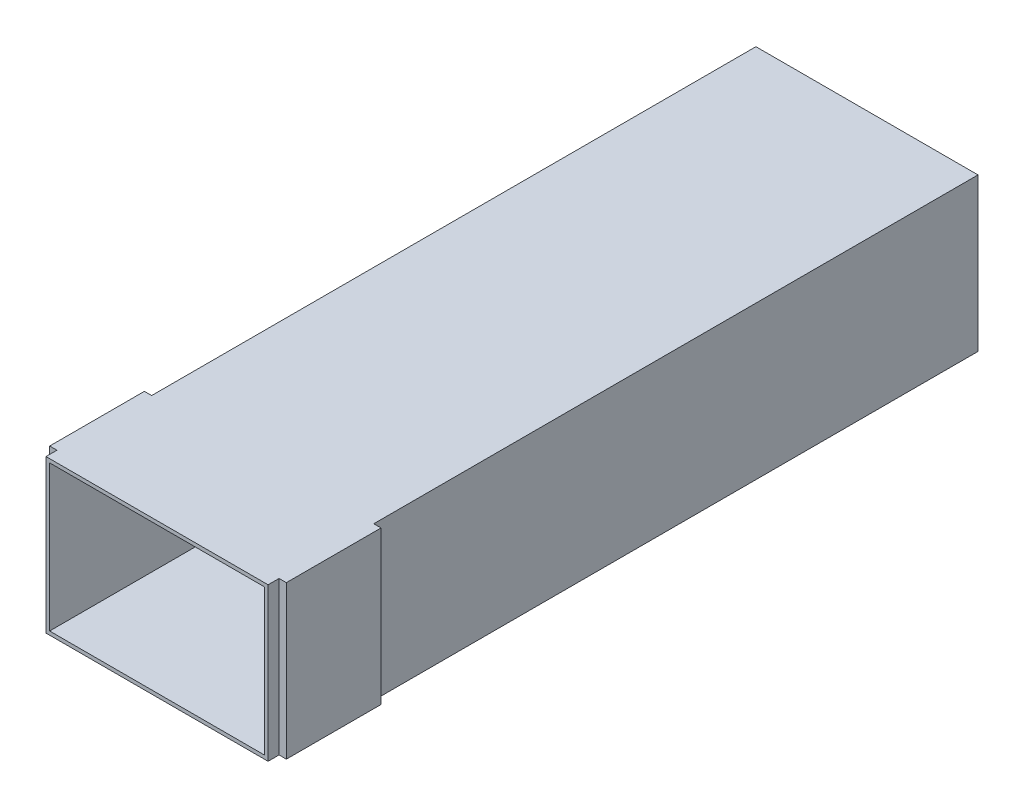
ISO-10303-21;
HEADER;
FILE_DESCRIPTION(('STEP AP214'),'2;1');
FILE_NAME('part.step','',(''),(''),'','','');
FILE_SCHEMA(('AUTOMOTIVE_DESIGN { 1 0 10303 214 1 1 1 1 }'));
ENDSEC;
DATA;
#1=APPLICATION_CONTEXT('core data for automotive mechanical design processes');
#2=APPLICATION_PROTOCOL_DEFINITION('international standard','automotive_design',2000,#1);
#3=PRODUCT_CONTEXT('',#1,'mechanical');
#4=PRODUCT('Part','Part','',(#3));
#5=PRODUCT_RELATED_PRODUCT_CATEGORY('part','',(#4));
#6=PRODUCT_DEFINITION_FORMATION('','',#4);
#7=PRODUCT_DEFINITION_CONTEXT('part definition',#1,'design');
#8=PRODUCT_DEFINITION('design','',#6,#7);
#9=PRODUCT_DEFINITION_SHAPE('','',#8);
#10=(LENGTH_UNIT() NAMED_UNIT(*) SI_UNIT(.MILLI.,.METRE.));
#11=(NAMED_UNIT(*) PLANE_ANGLE_UNIT() SI_UNIT($,.RADIAN.));
#12=(NAMED_UNIT(*) SI_UNIT($,.STERADIAN.) SOLID_ANGLE_UNIT());
#13=UNCERTAINTY_MEASURE_WITH_UNIT(LENGTH_MEASURE(1.E-05),#10,'distance_accuracy_value','');
#14=(GEOMETRIC_REPRESENTATION_CONTEXT(3) GLOBAL_UNCERTAINTY_ASSIGNED_CONTEXT((#13)) GLOBAL_UNIT_ASSIGNED_CONTEXT((#10,
#11,#12)) REPRESENTATION_CONTEXT('',''));
#15=CARTESIAN_POINT('',(0.,0.,0.));
#16=DIRECTION('',(0.,0.,1.));
#17=DIRECTION('',(1.,0.,0.));
#18=AXIS2_PLACEMENT_3D('',#15,#16,#17);
#19=CARTESIAN_POINT('',(-15.25,10.5,-7.99528968755595));
#20=DIRECTION('',(1.,0.,0.));
#21=DIRECTION('',(0.,0.,-1.));
#22=AXIS2_PLACEMENT_3D('',#19,#20,#21);
#23=PLANE('',#22);
#24=DIRECTION('',(0.,0.,1.));
#25=VECTOR('',#24,1.);
#26=CARTESIAN_POINT('',(-15.25,10.5,-7.99528968755595));
#27=LINE('',#26,#25);
#28=CARTESIAN_POINT('',(-15.25,10.5,40.));
#29=VERTEX_POINT('',#28);
#30=CARTESIAN_POINT('',(-15.25,10.5,40.7547103124441));
#31=VERTEX_POINT('',#30);
#32=EDGE_CURVE('E194',#29,#31,#27,.T.);
#33=ORIENTED_EDGE('',*,*,#32,.F.);
#34=DIRECTION('',(0.,-1.,0.));
#35=VECTOR('',#34,1.);
#36=CARTESIAN_POINT('',(-15.25,0.,40.));
#37=LINE('',#36,#35);
#38=CARTESIAN_POINT('',(-15.25,0.,40.));
#39=VERTEX_POINT('',#38);
#40=EDGE_CURVE('E156',#29,#39,#37,.T.);
#41=ORIENTED_EDGE('',*,*,#40,.T.);
#42=DIRECTION('',(0.,0.,1.));
#43=VECTOR('',#42,1.);
#44=CARTESIAN_POINT('',(-15.25,0.,-7.99528968755595));
#45=LINE('',#44,#43);
#46=CARTESIAN_POINT('',(-15.25,0.,40.7547103124441));
#47=VERTEX_POINT('',#46);
#48=EDGE_CURVE('E331',#39,#47,#45,.T.);
#49=ORIENTED_EDGE('',*,*,#48,.T.);
#50=DIRECTION('',(0.,-1.,0.));
#51=VECTOR('',#50,1.);
#52=CARTESIAN_POINT('',(-15.25,10.5,40.7547103124441));
#53=LINE('',#52,#51);
#54=EDGE_CURVE('E11',#31,#47,#53,.T.);
#55=ORIENTED_EDGE('',*,*,#54,.F.);
#56=EDGE_LOOP('',(#33,#41,#49,#55));
#57=FACE_BOUND('',#56,.T.);
#58=ADVANCED_FACE('F33',(#57),#23,.F.);
#59=CARTESIAN_POINT('',(0.,10.5,-7.99528968755595));
#60=DIRECTION('',(-1.,0.,0.));
#61=DIRECTION('',(0.,0.,1.));
#62=AXIS2_PLACEMENT_3D('',#59,#60,#61);
#63=PLANE('',#62);
#64=DIRECTION('',(0.,-1.,0.));
#65=VECTOR('',#64,1.);
#66=CARTESIAN_POINT('',(0.,0.,40.));
#67=LINE('',#66,#65);
#68=CARTESIAN_POINT('',(0.,10.5,40.));
#69=VERTEX_POINT('',#68);
#70=CARTESIAN_POINT('',(0.,0.,40.));
#71=VERTEX_POINT('',#70);
#72=EDGE_CURVE('E58',#69,#71,#67,.T.);
#73=ORIENTED_EDGE('',*,*,#72,.F.);
#74=DIRECTION('',(0.,0.,-1.));
#75=VECTOR('',#74,1.);
#76=CARTESIAN_POINT('',(0.,10.5,-7.99528968755595));
#77=LINE('',#76,#75);
#78=CARTESIAN_POINT('',(0.,10.5,40.7547103124441));
#79=VERTEX_POINT('',#78);
#80=EDGE_CURVE('E217',#79,#69,#77,.T.);
#81=ORIENTED_EDGE('',*,*,#80,.F.);
#82=DIRECTION('',(0.,-1.,0.));
#83=VECTOR('',#82,1.);
#84=CARTESIAN_POINT('',(0.,10.5,40.7547103124441));
#85=LINE('',#84,#83);
#86=CARTESIAN_POINT('',(0.,0.,40.7547103124441));
#87=VERTEX_POINT('',#86);
#88=EDGE_CURVE('E42',#79,#87,#85,.T.);
#89=ORIENTED_EDGE('',*,*,#88,.T.);
#90=DIRECTION('',(0.,0.,-1.));
#91=VECTOR('',#90,1.);
#92=CARTESIAN_POINT('',(0.,0.,-7.99528968755595));
#93=LINE('',#92,#91);
#94=EDGE_CURVE('E222',#87,#71,#93,.T.);
#95=ORIENTED_EDGE('',*,*,#94,.T.);
#96=EDGE_LOOP('',(#73,#81,#89,#95));
#97=FACE_BOUND('',#96,.T.);
#98=ADVANCED_FACE('F238',(#97),#63,.F.);
#99=DIRECTION('',(0.,1.,0.));
#100=VECTOR('',#99,1.);
#101=CARTESIAN_POINT('',(0.,0.,33.5));
#102=LINE('',#101,#100);
#103=CARTESIAN_POINT('',(0.,0.,33.5));
#104=VERTEX_POINT('',#103);
#105=CARTESIAN_POINT('',(0.,10.5,33.5));
#106=VERTEX_POINT('',#105);
#107=EDGE_CURVE('E261',#104,#106,#102,.T.);
#108=ORIENTED_EDGE('',*,*,#107,.F.);
#109=CARTESIAN_POINT('',(0.,0.,-7.99528968755595));
#110=VERTEX_POINT('',#109);
#111=EDGE_CURVE('E219',#104,#110,#93,.T.);
#112=ORIENTED_EDGE('',*,*,#111,.T.);
#113=DIRECTION('',(0.,-1.,0.));
#114=VECTOR('',#113,1.);
#115=CARTESIAN_POINT('',(0.,10.5,-7.99528968755595));
#116=LINE('',#115,#114);
#117=CARTESIAN_POINT('',(0.,10.5,-7.99528968755595));
#118=VERTEX_POINT('',#117);
#119=EDGE_CURVE('E232',#118,#110,#116,.T.);
#120=ORIENTED_EDGE('',*,*,#119,.F.);
#121=EDGE_CURVE('E208',#106,#118,#77,.T.);
#122=ORIENTED_EDGE('',*,*,#121,.F.);
#123=EDGE_LOOP('',(#108,#112,#120,#122));
#124=FACE_BOUND('',#123,.T.);
#125=ADVANCED_FACE('F296',(#124),#63,.F.);
#126=CARTESIAN_POINT('',(-15.25,10.5,40.7547103124441));
#127=DIRECTION('',(0.,0.,-1.));
#128=DIRECTION('',(-1.,0.,0.));
#129=AXIS2_PLACEMENT_3D('',#126,#127,#128);
#130=PLANE('',#129);
#131=DIRECTION('',(1.,0.,0.));
#132=VECTOR('',#131,1.);
#133=CARTESIAN_POINT('',(-15.25,0.,40.7547103124441));
#134=LINE('',#133,#132);
#135=EDGE_CURVE('E223',#47,#87,#134,.T.);
#136=ORIENTED_EDGE('',*,*,#135,.T.);
#137=ORIENTED_EDGE('',*,*,#88,.F.);
#138=DIRECTION('',(1.,0.,0.));
#139=VECTOR('',#138,1.);
#140=CARTESIAN_POINT('',(-15.25,10.5,40.7547103124441));
#141=LINE('',#140,#139);
#142=EDGE_CURVE('E205',#31,#79,#141,.T.);
#143=ORIENTED_EDGE('',*,*,#142,.F.);
#144=ORIENTED_EDGE('',*,*,#54,.T.);
#145=EDGE_LOOP('',(#136,#137,#143,#144));
#146=FACE_BOUND('',#145,.T.);
#147=DIRECTION('',(1.,0.,0.));
#148=VECTOR('',#147,1.);
#149=CARTESIAN_POINT('',(-15.25,0.25,40.7547103124441));
#150=LINE('',#149,#148);
#151=CARTESIAN_POINT('',(-15.,0.25,40.7547103124441));
#152=VERTEX_POINT('',#151);
#153=CARTESIAN_POINT('',(-0.249999999999993,0.25,40.7547103124441));
#154=VERTEX_POINT('',#153);
#155=EDGE_CURVE('E350',#152,#154,#150,.T.);
#156=ORIENTED_EDGE('',*,*,#155,.F.);
#157=DIRECTION('',(0.,-1.,0.));
#158=VECTOR('',#157,1.);
#159=CARTESIAN_POINT('',(-15.,10.5,40.7547103124441));
#160=LINE('',#159,#158);
#161=CARTESIAN_POINT('',(-15.,10.25,40.7547103124441));
#162=VERTEX_POINT('',#161);
#163=EDGE_CURVE('E333',#162,#152,#160,.T.);
#164=ORIENTED_EDGE('',*,*,#163,.F.);
#165=DIRECTION('',(1.,0.,0.));
#166=VECTOR('',#165,1.);
#167=CARTESIAN_POINT('',(-15.25,10.25,40.7547103124441));
#168=LINE('',#167,#166);
#169=CARTESIAN_POINT('',(-0.249999999999993,10.25,40.7547103124441));
#170=VERTEX_POINT('',#169);
#171=EDGE_CURVE('E203',#162,#170,#168,.T.);
#172=ORIENTED_EDGE('',*,*,#171,.T.);
#173=DIRECTION('',(0.,-1.,0.));
#174=VECTOR('',#173,1.);
#175=CARTESIAN_POINT('',(-0.249999999999993,10.5,40.7547103124441));
#176=LINE('',#175,#174);
#177=EDGE_CURVE('E338',#170,#154,#176,.T.);
#178=ORIENTED_EDGE('',*,*,#177,.T.);
#179=EDGE_LOOP('',(#156,#164,#172,#178));
#180=FACE_BOUND('',#179,.T.);
#181=ADVANCED_FACE('F322',(#146,#180),#130,.F.);
#182=CARTESIAN_POINT('',(-15.25,0.,-7.99528968755595));
#183=VERTEX_POINT('',#182);
#184=CARTESIAN_POINT('',(-15.25,0.,33.5));
#185=VERTEX_POINT('',#184);
#186=EDGE_CURVE('E330',#183,#185,#45,.T.);
#187=ORIENTED_EDGE('',*,*,#186,.T.);
#188=DIRECTION('',(0.,1.,0.));
#189=VECTOR('',#188,1.);
#190=CARTESIAN_POINT('',(-15.25,0.,33.5));
#191=LINE('',#190,#189);
#192=CARTESIAN_POINT('',(-15.25,10.5,33.5));
#193=VERTEX_POINT('',#192);
#194=EDGE_CURVE('E167',#185,#193,#191,.T.);
#195=ORIENTED_EDGE('',*,*,#194,.T.);
#196=CARTESIAN_POINT('',(-15.25,10.5,-7.99528968755595));
#197=VERTEX_POINT('',#196);
#198=EDGE_CURVE('E197',#197,#193,#27,.T.);
#199=ORIENTED_EDGE('',*,*,#198,.F.);
#200=DIRECTION('',(0.,-1.,0.));
#201=VECTOR('',#200,1.);
#202=CARTESIAN_POINT('',(-15.25,10.5,-7.99528968755595));
#203=LINE('',#202,#201);
#204=EDGE_CURVE('E229',#197,#183,#203,.T.);
#205=ORIENTED_EDGE('',*,*,#204,.T.);
#206=EDGE_LOOP('',(#187,#195,#199,#205));
#207=FACE_BOUND('',#206,.T.);
#208=ADVANCED_FACE('F35',(#207),#23,.F.);
#209=CARTESIAN_POINT('',(-15.25,10.5,-7.99528968755595));
#210=DIRECTION('',(0.,0.,1.));
#211=DIRECTION('',(1.,0.,0.));
#212=AXIS2_PLACEMENT_3D('',#209,#210,#211);
#213=PLANE('',#212);
#214=DIRECTION('',(-1.,0.,0.));
#215=VECTOR('',#214,1.);
#216=CARTESIAN_POINT('',(-15.25,0.,-7.99528968755595));
#217=LINE('',#216,#215);
#218=EDGE_CURVE('E198',#110,#183,#217,.T.);
#219=ORIENTED_EDGE('',*,*,#218,.T.);
#220=ORIENTED_EDGE('',*,*,#204,.F.);
#221=DIRECTION('',(-1.,0.,0.));
#222=VECTOR('',#221,1.);
#223=CARTESIAN_POINT('',(-15.25,10.5,-7.99528968755595));
#224=LINE('',#223,#222);
#225=EDGE_CURVE('E211',#118,#197,#224,.T.);
#226=ORIENTED_EDGE('',*,*,#225,.F.);
#227=ORIENTED_EDGE('',*,*,#119,.T.);
#228=EDGE_LOOP('',(#219,#220,#226,#227));
#229=FACE_BOUND('',#228,.T.);
#230=ADVANCED_FACE('F299',(#229),#213,.F.);
#231=CARTESIAN_POINT('',(0.,10.5,0.));
#232=DIRECTION('',(0.,1.,0.));
#233=DIRECTION('',(0.,0.,1.));
#234=AXIS2_PLACEMENT_3D('',#231,#232,#233);
#235=PLANE('',#234);
#236=ORIENTED_EDGE('',*,*,#198,.T.);
#237=DIRECTION('',(1.,0.,0.));
#238=VECTOR('',#237,1.);
#239=CARTESIAN_POINT('',(-15.75,10.5,33.5));
#240=LINE('',#239,#238);
#241=CARTESIAN_POINT('',(-15.75,10.5,33.5));
#242=VERTEX_POINT('',#241);
#243=EDGE_CURVE('E50',#242,#193,#240,.T.);
#244=ORIENTED_EDGE('',*,*,#243,.F.);
#245=DIRECTION('',(0.,0.,1.));
#246=VECTOR('',#245,1.);
#247=CARTESIAN_POINT('',(-15.75,10.5,40.));
#248=LINE('',#247,#246);
#249=CARTESIAN_POINT('',(-15.75,10.5,40.));
#250=VERTEX_POINT('',#249);
#251=EDGE_CURVE('E164',#242,#250,#248,.T.);
#252=ORIENTED_EDGE('',*,*,#251,.T.);
#253=DIRECTION('',(1.,0.,0.));
#254=VECTOR('',#253,1.);
#255=CARTESIAN_POINT('',(-15.75,10.5,40.));
#256=LINE('',#255,#254);
#257=EDGE_CURVE('E150',#250,#29,#256,.T.);
#258=ORIENTED_EDGE('',*,*,#257,.T.);
#259=ORIENTED_EDGE('',*,*,#32,.T.);
#260=ORIENTED_EDGE('',*,*,#142,.T.);
#261=ORIENTED_EDGE('',*,*,#80,.T.);
#262=DIRECTION('',(-1.,0.,0.));
#263=VECTOR('',#262,1.);
#264=CARTESIAN_POINT('',(0.500000000000006,10.5,40.));
#265=LINE('',#264,#263);
#266=CARTESIAN_POINT('',(0.500000000000006,10.5,40.));
#267=VERTEX_POINT('',#266);
#268=EDGE_CURVE('E260',#267,#69,#265,.T.);
#269=ORIENTED_EDGE('',*,*,#268,.F.);
#270=DIRECTION('',(0.,0.,1.));
#271=VECTOR('',#270,1.);
#272=CARTESIAN_POINT('',(0.500000000000006,10.5,40.));
#273=LINE('',#272,#271);
#274=CARTESIAN_POINT('',(0.500000000000005,10.5,33.5));
#275=VERTEX_POINT('',#274);
#276=EDGE_CURVE('E273',#275,#267,#273,.T.);
#277=ORIENTED_EDGE('',*,*,#276,.F.);
#278=DIRECTION('',(-1.,0.,0.));
#279=VECTOR('',#278,1.);
#280=CARTESIAN_POINT('',(0.500000000000005,10.5,33.5));
#281=LINE('',#280,#279);
#282=EDGE_CURVE('E279',#275,#106,#281,.T.);
#283=ORIENTED_EDGE('',*,*,#282,.T.);
#284=ORIENTED_EDGE('',*,*,#121,.T.);
#285=ORIENTED_EDGE('',*,*,#225,.T.);
#286=EDGE_LOOP('',(#236,#244,#252,#258,#259,#260,#261,#269,#277,#283,#284,#285));
#287=FACE_BOUND('',#286,.T.);
#288=ADVANCED_FACE('F170',(#287),#235,.T.);
#289=CARTESIAN_POINT('',(0.,0.,0.));
#290=DIRECTION('',(0.,1.,0.));
#291=DIRECTION('',(0.,0.,1.));
#292=AXIS2_PLACEMENT_3D('',#289,#290,#291);
#293=PLANE('',#292);
#294=ORIENTED_EDGE('',*,*,#186,.F.);
#295=ORIENTED_EDGE('',*,*,#218,.F.);
#296=ORIENTED_EDGE('',*,*,#111,.F.);
#297=DIRECTION('',(-1.,0.,0.));
#298=VECTOR('',#297,1.);
#299=CARTESIAN_POINT('',(0.500000000000005,0.,33.5));
#300=LINE('',#299,#298);
#301=CARTESIAN_POINT('',(0.500000000000005,0.,33.5));
#302=VERTEX_POINT('',#301);
#303=EDGE_CURVE('E255',#302,#104,#300,.T.);
#304=ORIENTED_EDGE('',*,*,#303,.F.);
#305=DIRECTION('',(0.,0.,-1.));
#306=VECTOR('',#305,1.);
#307=CARTESIAN_POINT('',(0.500000000000006,0.,40.));
#308=LINE('',#307,#306);
#309=CARTESIAN_POINT('',(0.500000000000006,0.,40.));
#310=VERTEX_POINT('',#309);
#311=EDGE_CURVE('E250',#310,#302,#308,.T.);
#312=ORIENTED_EDGE('',*,*,#311,.F.);
#313=DIRECTION('',(-1.,0.,0.));
#314=VECTOR('',#313,1.);
#315=CARTESIAN_POINT('',(0.500000000000006,0.,40.));
#316=LINE('',#315,#314);
#317=EDGE_CURVE('E248',#310,#71,#316,.T.);
#318=ORIENTED_EDGE('',*,*,#317,.T.);
#319=ORIENTED_EDGE('',*,*,#94,.F.);
#320=ORIENTED_EDGE('',*,*,#135,.F.);
#321=ORIENTED_EDGE('',*,*,#48,.F.);
#322=DIRECTION('',(1.,0.,0.));
#323=VECTOR('',#322,1.);
#324=CARTESIAN_POINT('',(-15.75,0.,40.));
#325=LINE('',#324,#323);
#326=CARTESIAN_POINT('',(-15.75,0.,40.));
#327=VERTEX_POINT('',#326);
#328=EDGE_CURVE('E176',#327,#39,#325,.T.);
#329=ORIENTED_EDGE('',*,*,#328,.F.);
#330=DIRECTION('',(0.,0.,-1.));
#331=VECTOR('',#330,1.);
#332=CARTESIAN_POINT('',(-15.75,0.,40.));
#333=LINE('',#332,#331);
#334=CARTESIAN_POINT('',(-15.75,0.,33.5));
#335=VERTEX_POINT('',#334);
#336=EDGE_CURVE('E166',#327,#335,#333,.T.);
#337=ORIENTED_EDGE('',*,*,#336,.T.);
#338=DIRECTION('',(1.,0.,0.));
#339=VECTOR('',#338,1.);
#340=CARTESIAN_POINT('',(-15.75,0.,33.5));
#341=LINE('',#340,#339);
#342=EDGE_CURVE('E186',#335,#185,#341,.T.);
#343=ORIENTED_EDGE('',*,*,#342,.T.);
#344=EDGE_LOOP('',(#294,#295,#296,#304,#312,#318,#319,#320,#321,#329,#337,#343));
#345=FACE_BOUND('',#344,.T.);
#346=ADVANCED_FACE('F245',(#345),#293,.F.);
#347=CARTESIAN_POINT('',(-15.,10.5,-7.99528968755595));
#348=DIRECTION('',(1.,0.,0.));
#349=DIRECTION('',(0.,0.,-1.));
#350=AXIS2_PLACEMENT_3D('',#347,#348,#349);
#351=PLANE('',#350);
#352=DIRECTION('',(0.,0.,1.));
#353=VECTOR('',#352,1.);
#354=CARTESIAN_POINT('',(-15.,0.25,-7.99528968755595));
#355=LINE('',#354,#353);
#356=CARTESIAN_POINT('',(-15.,0.25,-7.74528968755595));
#357=VERTEX_POINT('',#356);
#358=EDGE_CURVE('E254',#357,#152,#355,.T.);
#359=ORIENTED_EDGE('',*,*,#358,.F.);
#360=DIRECTION('',(0.,-1.,0.));
#361=VECTOR('',#360,1.);
#362=CARTESIAN_POINT('',(-15.,10.5,-7.74528968755595));
#363=LINE('',#362,#361);
#364=CARTESIAN_POINT('',(-15.,10.25,-7.74528968755595));
#365=VERTEX_POINT('',#364);
#366=EDGE_CURVE('E373',#365,#357,#363,.T.);
#367=ORIENTED_EDGE('',*,*,#366,.F.);
#368=DIRECTION('',(0.,0.,1.));
#369=VECTOR('',#368,1.);
#370=CARTESIAN_POINT('',(-15.,10.25,-7.99528968755595));
#371=LINE('',#370,#369);
#372=EDGE_CURVE('E375',#365,#162,#371,.T.);
#373=ORIENTED_EDGE('',*,*,#372,.T.);
#374=ORIENTED_EDGE('',*,*,#163,.T.);
#375=EDGE_LOOP('',(#359,#367,#373,#374));
#376=FACE_BOUND('',#375,.T.);
#377=ADVANCED_FACE('F381',(#376),#351,.T.);
#378=CARTESIAN_POINT('',(-0.25,10.5,-7.99528968755595));
#379=DIRECTION('',(-1.,0.,0.));
#380=DIRECTION('',(0.,0.,1.));
#381=AXIS2_PLACEMENT_3D('',#378,#379,#380);
#382=PLANE('',#381);
#383=DIRECTION('',(0.,0.,-1.));
#384=VECTOR('',#383,1.);
#385=CARTESIAN_POINT('',(-0.25,0.25,-7.99528968755595));
#386=LINE('',#385,#384);
#387=CARTESIAN_POINT('',(-0.25,0.25,-7.74528968755595));
#388=VERTEX_POINT('',#387);
#389=EDGE_CURVE('E351',#154,#388,#386,.T.);
#390=ORIENTED_EDGE('',*,*,#389,.F.);
#391=ORIENTED_EDGE('',*,*,#177,.F.);
#392=DIRECTION('',(0.,0.,-1.));
#393=VECTOR('',#392,1.);
#394=CARTESIAN_POINT('',(-0.25,10.25,-7.99528968755595));
#395=LINE('',#394,#393);
#396=CARTESIAN_POINT('',(-0.25,10.25,-7.74528968755595));
#397=VERTEX_POINT('',#396);
#398=EDGE_CURVE('E348',#170,#397,#395,.T.);
#399=ORIENTED_EDGE('',*,*,#398,.T.);
#400=DIRECTION('',(0.,-1.,0.));
#401=VECTOR('',#400,1.);
#402=CARTESIAN_POINT('',(-0.25,10.5,-7.74528968755595));
#403=LINE('',#402,#401);
#404=EDGE_CURVE('E345',#397,#388,#403,.T.);
#405=ORIENTED_EDGE('',*,*,#404,.T.);
#406=EDGE_LOOP('',(#390,#391,#399,#405));
#407=FACE_BOUND('',#406,.T.);
#408=ADVANCED_FACE('F365',(#407),#382,.T.);
#409=CARTESIAN_POINT('',(-15.25,10.5,-7.74528968755595));
#410=DIRECTION('',(0.,0.,1.));
#411=DIRECTION('',(1.,0.,0.));
#412=AXIS2_PLACEMENT_3D('',#409,#410,#411);
#413=PLANE('',#412);
#414=DIRECTION('',(-1.,0.,0.));
#415=VECTOR('',#414,1.);
#416=CARTESIAN_POINT('',(-15.25,0.25,-7.74528968755595));
#417=LINE('',#416,#415);
#418=EDGE_CURVE('E355',#388,#357,#417,.T.);
#419=ORIENTED_EDGE('',*,*,#418,.F.);
#420=ORIENTED_EDGE('',*,*,#404,.F.);
#421=DIRECTION('',(-1.,0.,0.));
#422=VECTOR('',#421,1.);
#423=CARTESIAN_POINT('',(-15.25,10.25,-7.74528968755595));
#424=LINE('',#423,#422);
#425=EDGE_CURVE('E372',#397,#365,#424,.T.);
#426=ORIENTED_EDGE('',*,*,#425,.T.);
#427=ORIENTED_EDGE('',*,*,#366,.T.);
#428=EDGE_LOOP('',(#419,#420,#426,#427));
#429=FACE_BOUND('',#428,.T.);
#430=ADVANCED_FACE('F380',(#429),#413,.T.);
#431=CARTESIAN_POINT('',(0.,10.25,0.));
#432=DIRECTION('',(0.,1.,0.));
#433=DIRECTION('',(0.,0.,1.));
#434=AXIS2_PLACEMENT_3D('',#431,#432,#433);
#435=PLANE('',#434);
#436=ORIENTED_EDGE('',*,*,#372,.F.);
#437=ORIENTED_EDGE('',*,*,#425,.F.);
#438=ORIENTED_EDGE('',*,*,#398,.F.);
#439=ORIENTED_EDGE('',*,*,#171,.F.);
#440=EDGE_LOOP('',(#436,#437,#438,#439));
#441=FACE_BOUND('',#440,.T.);
#442=ADVANCED_FACE('F371',(#441),#435,.F.);
#443=CARTESIAN_POINT('',(0.,0.25,0.));
#444=DIRECTION('',(0.,1.,0.));
#445=DIRECTION('',(0.,0.,1.));
#446=AXIS2_PLACEMENT_3D('',#443,#444,#445);
#447=PLANE('',#446);
#448=ORIENTED_EDGE('',*,*,#358,.T.);
#449=ORIENTED_EDGE('',*,*,#155,.T.);
#450=ORIENTED_EDGE('',*,*,#389,.T.);
#451=ORIENTED_EDGE('',*,*,#418,.T.);
#452=EDGE_LOOP('',(#448,#449,#450,#451));
#453=FACE_BOUND('',#452,.T.);
#454=ADVANCED_FACE('F356',(#453),#447,.T.);
#455=CARTESIAN_POINT('',(0.500000000000006,0.,40.));
#456=DIRECTION('',(0.,0.,-1.));
#457=DIRECTION('',(-1.,0.,0.));
#458=AXIS2_PLACEMENT_3D('',#455,#456,#457);
#459=PLANE('',#458);
#460=ORIENTED_EDGE('',*,*,#72,.T.);
#461=ORIENTED_EDGE('',*,*,#317,.F.);
#462=DIRECTION('',(0.,-1.,0.));
#463=VECTOR('',#462,1.);
#464=CARTESIAN_POINT('',(0.500000000000006,0.,40.));
#465=LINE('',#464,#463);
#466=EDGE_CURVE('E264',#267,#310,#465,.T.);
#467=ORIENTED_EDGE('',*,*,#466,.F.);
#468=ORIENTED_EDGE('',*,*,#268,.T.);
#469=EDGE_LOOP('',(#460,#461,#467,#468));
#470=FACE_BOUND('',#469,.T.);
#471=ADVANCED_FACE('F258',(#470),#459,.F.);
#472=CARTESIAN_POINT('',(0.500000000000005,0.,33.5));
#473=DIRECTION('',(0.,0.,1.));
#474=DIRECTION('',(1.,0.,0.));
#475=AXIS2_PLACEMENT_3D('',#472,#473,#474);
#476=PLANE('',#475);
#477=ORIENTED_EDGE('',*,*,#107,.T.);
#478=ORIENTED_EDGE('',*,*,#282,.F.);
#479=DIRECTION('',(0.,1.,0.));
#480=VECTOR('',#479,1.);
#481=CARTESIAN_POINT('',(0.500000000000005,0.,33.5));
#482=LINE('',#481,#480);
#483=EDGE_CURVE('E291',#302,#275,#482,.T.);
#484=ORIENTED_EDGE('',*,*,#483,.F.);
#485=ORIENTED_EDGE('',*,*,#303,.T.);
#486=EDGE_LOOP('',(#477,#478,#484,#485));
#487=FACE_BOUND('',#486,.T.);
#488=ADVANCED_FACE('F289',(#487),#476,.F.);
#489=CARTESIAN_POINT('',(0.5,0.,0.));
#490=DIRECTION('',(-1.,0.,0.));
#491=DIRECTION('',(0.,0.,1.));
#492=AXIS2_PLACEMENT_3D('',#489,#490,#491);
#493=PLANE('',#492);
#494=ORIENTED_EDGE('',*,*,#466,.T.);
#495=ORIENTED_EDGE('',*,*,#311,.T.);
#496=ORIENTED_EDGE('',*,*,#483,.T.);
#497=ORIENTED_EDGE('',*,*,#276,.T.);
#498=EDGE_LOOP('',(#494,#495,#496,#497));
#499=FACE_BOUND('',#498,.T.);
#500=ADVANCED_FACE('F305',(#499),#493,.F.);
#501=CARTESIAN_POINT('',(-15.75,0.,40.));
#502=DIRECTION('',(0.,0.,1.));
#503=DIRECTION('',(1.,0.,0.));
#504=AXIS2_PLACEMENT_3D('',#501,#502,#503);
#505=PLANE('',#504);
#506=ORIENTED_EDGE('',*,*,#40,.F.);
#507=ORIENTED_EDGE('',*,*,#257,.F.);
#508=DIRECTION('',(0.,-1.,0.));
#509=VECTOR('',#508,1.);
#510=CARTESIAN_POINT('',(-15.75,0.,40.));
#511=LINE('',#510,#509);
#512=EDGE_CURVE('E153',#250,#327,#511,.T.);
#513=ORIENTED_EDGE('',*,*,#512,.T.);
#514=ORIENTED_EDGE('',*,*,#328,.T.);
#515=EDGE_LOOP('',(#506,#507,#513,#514));
#516=FACE_BOUND('',#515,.T.);
#517=ADVANCED_FACE('F152',(#516),#505,.T.);
#518=CARTESIAN_POINT('',(-15.75,0.,33.5));
#519=DIRECTION('',(0.,0.,-1.));
#520=DIRECTION('',(-1.,0.,0.));
#521=AXIS2_PLACEMENT_3D('',#518,#519,#520);
#522=PLANE('',#521);
#523=ORIENTED_EDGE('',*,*,#194,.F.);
#524=ORIENTED_EDGE('',*,*,#342,.F.);
#525=DIRECTION('',(0.,1.,0.));
#526=VECTOR('',#525,1.);
#527=CARTESIAN_POINT('',(-15.75,0.,33.5));
#528=LINE('',#527,#526);
#529=EDGE_CURVE('E171',#335,#242,#528,.T.);
#530=ORIENTED_EDGE('',*,*,#529,.T.);
#531=ORIENTED_EDGE('',*,*,#243,.T.);
#532=EDGE_LOOP('',(#523,#524,#530,#531));
#533=FACE_BOUND('',#532,.T.);
#534=ADVANCED_FACE('F312',(#533),#522,.T.);
#535=CARTESIAN_POINT('',(-15.75,0.,0.));
#536=DIRECTION('',(1.,0.,0.));
#537=DIRECTION('',(0.,0.,1.));
#538=AXIS2_PLACEMENT_3D('',#535,#536,#537);
#539=PLANE('',#538);
#540=ORIENTED_EDGE('',*,*,#512,.F.);
#541=ORIENTED_EDGE('',*,*,#251,.F.);
#542=ORIENTED_EDGE('',*,*,#529,.F.);
#543=ORIENTED_EDGE('',*,*,#336,.F.);
#544=EDGE_LOOP('',(#540,#541,#542,#543));
#545=FACE_BOUND('',#544,.T.);
#546=ADVANCED_FACE('F162',(#545),#539,.F.);
#547=CLOSED_SHELL('',(#58,#98,#125,#181,#208,#230,#288,#346,#377,#408,#430,#442,#454,#471,#488,
#500,#517,#534,#546));
#548=MANIFOLD_SOLID_BREP('B2',#547);
#549=ADVANCED_BREP_SHAPE_REPRESENTATION('',(#18,#548),#14);
#550=SHAPE_DEFINITION_REPRESENTATION(#9,#549);
ENDSEC;
END-ISO-10303-21;
